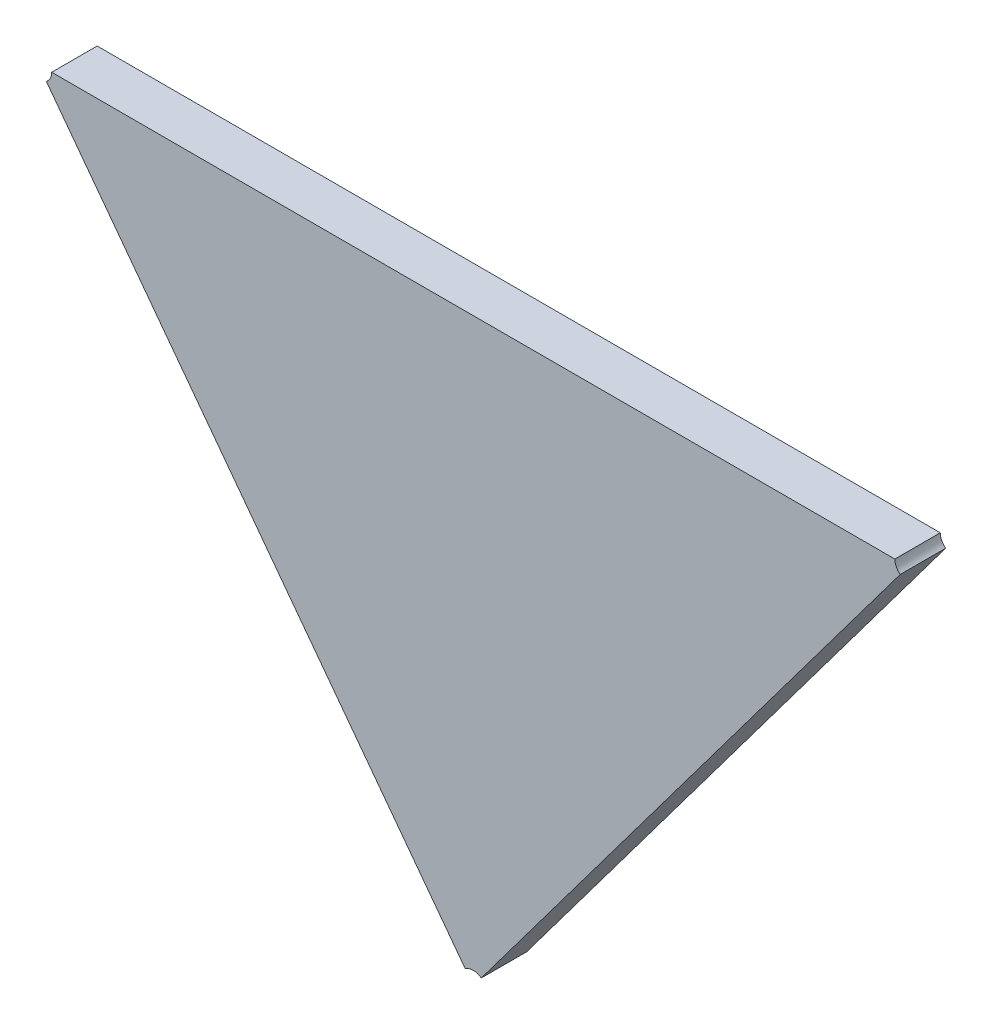
ISO-10303-21;
HEADER;
FILE_DESCRIPTION(('STEP AP214'),'2;1');
FILE_NAME('part.step','',(''),(''),'','','');
FILE_SCHEMA(('AUTOMOTIVE_DESIGN { 1 0 10303 214 1 1 1 1 }'));
ENDSEC;
DATA;
#1=APPLICATION_CONTEXT('core data for automotive mechanical design processes');
#2=APPLICATION_PROTOCOL_DEFINITION('international standard','automotive_design',2000,#1);
#3=PRODUCT_CONTEXT('',#1,'mechanical');
#4=PRODUCT('Part','Part','',(#3));
#5=PRODUCT_RELATED_PRODUCT_CATEGORY('part','',(#4));
#6=PRODUCT_DEFINITION_FORMATION('','',#4);
#7=PRODUCT_DEFINITION_CONTEXT('part definition',#1,'design');
#8=PRODUCT_DEFINITION('design','',#6,#7);
#9=PRODUCT_DEFINITION_SHAPE('','',#8);
#10=(LENGTH_UNIT() NAMED_UNIT(*) SI_UNIT(.MILLI.,.METRE.));
#11=(NAMED_UNIT(*) PLANE_ANGLE_UNIT() SI_UNIT($,.RADIAN.));
#12=(NAMED_UNIT(*) SI_UNIT($,.STERADIAN.) SOLID_ANGLE_UNIT());
#13=UNCERTAINTY_MEASURE_WITH_UNIT(LENGTH_MEASURE(1.E-05),#10,'distance_accuracy_value','');
#14=(GEOMETRIC_REPRESENTATION_CONTEXT(3) GLOBAL_UNCERTAINTY_ASSIGNED_CONTEXT((#13)) GLOBAL_UNIT_ASSIGNED_CONTEXT((#10,
#11,#12)) REPRESENTATION_CONTEXT('',''));
#15=CARTESIAN_POINT('',(0.,0.,0.));
#16=DIRECTION('',(0.,0.,1.));
#17=DIRECTION('',(1.,0.,0.));
#18=AXIS2_PLACEMENT_3D('',#15,#16,#17);
#19=CARTESIAN_POINT('',(-1.64562904813006,-1.33581418659048,0.0042));
#20=DIRECTION('',(0.,0.,1.));
#21=DIRECTION('',(1.,0.,0.));
#22=AXIS2_PLACEMENT_3D('',#19,#20,#21);
#23=PLANE('',#22);
#24=CARTESIAN_POINT('',(-1.71069826462096,-1.30862866219989,0.0042));
#25=DIRECTION('',(0.,0.,-1.));
#26=DIRECTION('',(1.,0.,0.));
#27=AXIS2_PLACEMENT_3D('',#24,#25,#26);
#28=CIRCLE('',#27,0.00199999999999999);
#29=CARTESIAN_POINT('',(-1.70869826462096,-1.30862866219989,0.0042));
#30=VERTEX_POINT('',#29);
#31=CARTESIAN_POINT('',(-1.70949881097527,-1.3102290718199,0.0042));
#32=VERTEX_POINT('',#31);
#33=EDGE_CURVE('E11',#30,#32,#28,.T.);
#34=ORIENTED_EDGE('',*,*,#33,.T.);
#35=DIRECTION('',(0.599726822848934,-0.800204810005241,0.));
#36=VECTOR('',#35,1.);
#37=CARTESIAN_POINT('',(-1.70949881097527,-1.3102290718199,0.0042));
#38=LINE('',#37,#36);
#39=CARTESIAN_POINT('',(-1.64682850177576,-1.39384894832924,0.0042));
#40=VERTEX_POINT('',#39);
#41=EDGE_CURVE('E114',#32,#40,#38,.T.);
#42=ORIENTED_EDGE('',*,*,#41,.T.);
#43=CARTESIAN_POINT('',(-1.64562904813006,-1.39544935794925,0.0042));
#44=DIRECTION('',(0.,0.,-1.));
#45=DIRECTION('',(-0.59972682284971,0.800204810004659,0.));
#46=AXIS2_PLACEMENT_3D('',#43,#44,#45);
#47=CIRCLE('',#46,0.00200000000000003);
#48=CARTESIAN_POINT('',(-1.64442959448436,-1.39384894832924,0.0042));
#49=VERTEX_POINT('',#48);
#50=EDGE_CURVE('E90',#40,#49,#47,.T.);
#51=ORIENTED_EDGE('',*,*,#50,.T.);
#52=DIRECTION('',(0.599726822848933,0.800204810005241,0.));
#53=VECTOR('',#52,1.);
#54=CARTESIAN_POINT('',(-1.64442959448436,-1.39384894832924,0.0042));
#55=LINE('',#54,#53);
#56=CARTESIAN_POINT('',(-1.58175928528485,-1.3102290718199,0.0042));
#57=VERTEX_POINT('',#56);
#58=EDGE_CURVE('E102',#49,#57,#55,.T.);
#59=ORIENTED_EDGE('',*,*,#58,.T.);
#60=CARTESIAN_POINT('',(-1.58055983163915,-1.30862866219989,0.0042));
#61=DIRECTION('',(0.,0.,-1.));
#62=DIRECTION('',(-0.59972682284971,-0.800204810004659,0.));
#63=AXIS2_PLACEMENT_3D('',#60,#61,#62);
#64=CIRCLE('',#63,0.00200000000000002);
#65=CARTESIAN_POINT('',(-1.58255983163915,-1.30862866219989,0.0042));
#66=VERTEX_POINT('',#65);
#67=EDGE_CURVE('E77',#57,#66,#64,.T.);
#68=ORIENTED_EDGE('',*,*,#67,.T.);
#69=DIRECTION('',(-1.,0.,0.));
#70=VECTOR('',#69,1.);
#71=CARTESIAN_POINT('',(-1.58255983163915,-1.30862866219989,0.0042));
#72=LINE('',#71,#70);
#73=EDGE_CURVE('E110',#66,#30,#72,.T.);
#74=ORIENTED_EDGE('',*,*,#73,.T.);
#75=EDGE_LOOP('',(#34,#42,#51,#59,#68,#74));
#76=FACE_BOUND('',#75,.T.);
#77=ADVANCED_FACE('F17',(#76),#23,.T.);
#78=CARTESIAN_POINT('',(-1.58055983163915,-1.30862866219989,-0.0026));
#79=DIRECTION('',(0.,1.,0.));
#80=DIRECTION('',(-1.,0.,0.));
#81=AXIS2_PLACEMENT_3D('',#78,#79,#80);
#82=PLANE('',#81);
#83=DIRECTION('',(0.,0.,1.));
#84=VECTOR('',#83,1.);
#85=CARTESIAN_POINT('',(-1.70869826462096,-1.30862866219989,-0.0026));
#86=LINE('',#85,#84);
#87=CARTESIAN_POINT('',(-1.70869826462096,-1.30862866219989,-0.0026));
#88=VERTEX_POINT('',#87);
#89=EDGE_CURVE('E24',#88,#30,#86,.T.);
#90=ORIENTED_EDGE('',*,*,#89,.T.);
#91=ORIENTED_EDGE('',*,*,#73,.F.);
#92=DIRECTION('',(0.,0.,-1.));
#93=VECTOR('',#92,1.);
#94=CARTESIAN_POINT('',(-1.58255983163915,-1.30862866219989,0.0042));
#95=LINE('',#94,#93);
#96=CARTESIAN_POINT('',(-1.58255983163915,-1.30862866219989,-0.0026));
#97=VERTEX_POINT('',#96);
#98=EDGE_CURVE('E104',#66,#97,#95,.T.);
#99=ORIENTED_EDGE('',*,*,#98,.T.);
#100=DIRECTION('',(-1.,0.,0.));
#101=VECTOR('',#100,1.);
#102=CARTESIAN_POINT('',(-1.58255983163915,-1.30862866219989,-0.0026));
#103=LINE('',#102,#101);
#104=EDGE_CURVE('E99',#97,#88,#103,.T.);
#105=ORIENTED_EDGE('',*,*,#104,.T.);
#106=EDGE_LOOP('',(#90,#91,#99,#105));
#107=FACE_BOUND('',#106,.T.);
#108=ADVANCED_FACE('F120',(#107),#82,.T.);
#109=CARTESIAN_POINT('',(-1.64562904813006,-1.39544935794925,-0.0026));
#110=DIRECTION('',(0.800204810005241,-0.599726822848934,0.));
#111=DIRECTION('',(0.599726822848934,0.800204810005241,0.));
#112=AXIS2_PLACEMENT_3D('',#109,#110,#111);
#113=PLANE('',#112);
#114=DIRECTION('',(0.,0.,-1.));
#115=VECTOR('',#114,1.);
#116=CARTESIAN_POINT('',(-1.64442959448436,-1.39384894832924,0.0042));
#117=LINE('',#116,#115);
#118=CARTESIAN_POINT('',(-1.64442959448436,-1.39384894832924,-0.0026));
#119=VERTEX_POINT('',#118);
#120=EDGE_CURVE('E112',#49,#119,#117,.T.);
#121=ORIENTED_EDGE('',*,*,#120,.T.);
#122=DIRECTION('',(0.599726822848934,0.80020481000524,0.));
#123=VECTOR('',#122,1.);
#124=CARTESIAN_POINT('',(-1.64442959448436,-1.39384894832924,-0.0026));
#125=LINE('',#124,#123);
#126=CARTESIAN_POINT('',(-1.58175928528485,-1.3102290718199,-0.0026));
#127=VERTEX_POINT('',#126);
#128=EDGE_CURVE('E85',#119,#127,#125,.T.);
#129=ORIENTED_EDGE('',*,*,#128,.T.);
#130=DIRECTION('',(0.,0.,1.));
#131=VECTOR('',#130,1.);
#132=CARTESIAN_POINT('',(-1.58175928528485,-1.3102290718199,-0.0026));
#133=LINE('',#132,#131);
#134=EDGE_CURVE('E96',#127,#57,#133,.T.);
#135=ORIENTED_EDGE('',*,*,#134,.T.);
#136=ORIENTED_EDGE('',*,*,#58,.F.);
#137=EDGE_LOOP('',(#121,#129,#135,#136));
#138=FACE_BOUND('',#137,.T.);
#139=ADVANCED_FACE('F127',(#138),#113,.T.);
#140=CARTESIAN_POINT('',(-1.62394239474017,-1.34119105521901,-0.0026));
#141=DIRECTION('',(0.,0.,1.));
#142=DIRECTION('',(1.,0.,0.));
#143=AXIS2_PLACEMENT_3D('',#140,#141,#142);
#144=PLANE('',#143);
#145=CARTESIAN_POINT('',(-1.71069826462096,-1.30862866219989,-0.0026));
#146=DIRECTION('',(0.,0.,1.));
#147=DIRECTION('',(0.599726822846601,-0.800204810006989,0.));
#148=AXIS2_PLACEMENT_3D('',#145,#146,#147);
#149=CIRCLE('',#148,0.00199999999999999);
#150=CARTESIAN_POINT('',(-1.70949881097527,-1.3102290718199,-0.0026));
#151=VERTEX_POINT('',#150);
#152=EDGE_CURVE('E107',#151,#88,#149,.T.);
#153=ORIENTED_EDGE('',*,*,#152,.T.);
#154=ORIENTED_EDGE('',*,*,#104,.F.);
#155=CARTESIAN_POINT('',(-1.58055983163915,-1.30862866219989,-0.0026));
#156=DIRECTION('',(0.,0.,1.));
#157=DIRECTION('',(-1.,0.,0.));
#158=AXIS2_PLACEMENT_3D('',#155,#156,#157);
#159=CIRCLE('',#158,0.00200000000000002);
#160=EDGE_CURVE('E78',#97,#127,#159,.T.);
#161=ORIENTED_EDGE('',*,*,#160,.T.);
#162=ORIENTED_EDGE('',*,*,#128,.F.);
#163=CARTESIAN_POINT('',(-1.64562904813006,-1.39544935794925,-0.0026));
#164=DIRECTION('',(0.,0.,1.));
#165=DIRECTION('',(0.59972682284971,0.800204810004659,0.));
#166=AXIS2_PLACEMENT_3D('',#163,#164,#165);
#167=CIRCLE('',#166,0.00200000000000003);
#168=CARTESIAN_POINT('',(-1.64682850177576,-1.39384894832924,-0.0026));
#169=VERTEX_POINT('',#168);
#170=EDGE_CURVE('E82',#119,#169,#167,.T.);
#171=ORIENTED_EDGE('',*,*,#170,.T.);
#172=DIRECTION('',(-0.599726822848935,0.80020481000524,0.));
#173=VECTOR('',#172,1.);
#174=CARTESIAN_POINT('',(-1.64682850177576,-1.39384894832924,-0.0026));
#175=LINE('',#174,#173);
#176=EDGE_CURVE('E67',#169,#151,#175,.T.);
#177=ORIENTED_EDGE('',*,*,#176,.T.);
#178=EDGE_LOOP('',(#153,#154,#161,#162,#171,#177));
#179=FACE_BOUND('',#178,.T.);
#180=ADVANCED_FACE('F83',(#179),#144,.F.);
#181=CARTESIAN_POINT('',(-1.64562904813006,-1.39544935794925,-0.0026));
#182=DIRECTION('',(0.800204810005241,0.599726822848934,0.));
#183=DIRECTION('',(-0.599726822848934,0.800204810005241,0.));
#184=AXIS2_PLACEMENT_3D('',#181,#182,#183);
#185=PLANE('',#184);
#186=DIRECTION('',(0.,0.,1.));
#187=VECTOR('',#186,1.);
#188=CARTESIAN_POINT('',(-1.70949881097527,-1.3102290718199,-0.0026));
#189=LINE('',#188,#187);
#190=EDGE_CURVE('E74',#151,#32,#189,.T.);
#191=ORIENTED_EDGE('',*,*,#190,.F.);
#192=ORIENTED_EDGE('',*,*,#176,.F.);
#193=DIRECTION('',(0.,0.,1.));
#194=VECTOR('',#193,1.);
#195=CARTESIAN_POINT('',(-1.64682850177576,-1.39384894832924,-0.0026));
#196=LINE('',#195,#194);
#197=EDGE_CURVE('E71',#169,#40,#196,.T.);
#198=ORIENTED_EDGE('',*,*,#197,.T.);
#199=ORIENTED_EDGE('',*,*,#41,.F.);
#200=EDGE_LOOP('',(#191,#192,#198,#199));
#201=FACE_BOUND('',#200,.T.);
#202=ADVANCED_FACE('F69',(#201),#185,.F.);
#203=CARTESIAN_POINT('',(-1.58055983163915,-1.30862866219989,-0.0018));
#204=DIRECTION('',(0.,0.,1.));
#205=DIRECTION('',(-1.,0.,0.));
#206=AXIS2_PLACEMENT_3D('',#203,#204,#205);
#207=CYLINDRICAL_SURFACE('',#206,0.00200000000000002);
#208=ORIENTED_EDGE('',*,*,#98,.F.);
#209=ORIENTED_EDGE('',*,*,#67,.F.);
#210=ORIENTED_EDGE('',*,*,#134,.F.);
#211=ORIENTED_EDGE('',*,*,#160,.F.);
#212=EDGE_LOOP('',(#208,#209,#210,#211));
#213=FACE_BOUND('',#212,.T.);
#214=ADVANCED_FACE('F124',(#213),#207,.F.);
#215=CARTESIAN_POINT('',(-1.64562904813006,-1.39544935794925,-0.0018));
#216=DIRECTION('',(0.,0.,1.));
#217=DIRECTION('',(-1.,0.,0.));
#218=AXIS2_PLACEMENT_3D('',#215,#216,#217);
#219=CYLINDRICAL_SURFACE('',#218,0.00200000000000003);
#220=ORIENTED_EDGE('',*,*,#120,.F.);
#221=ORIENTED_EDGE('',*,*,#50,.F.);
#222=ORIENTED_EDGE('',*,*,#197,.F.);
#223=ORIENTED_EDGE('',*,*,#170,.F.);
#224=EDGE_LOOP('',(#220,#221,#222,#223));
#225=FACE_BOUND('',#224,.T.);
#226=ADVANCED_FACE('F89',(#225),#219,.F.);
#227=CARTESIAN_POINT('',(-1.71069826462096,-1.30862866219989,-0.0018));
#228=DIRECTION('',(0.,0.,1.));
#229=DIRECTION('',(-1.,0.,0.));
#230=AXIS2_PLACEMENT_3D('',#227,#228,#229);
#231=CYLINDRICAL_SURFACE('',#230,0.00199999999999999);
#232=ORIENTED_EDGE('',*,*,#89,.F.);
#233=ORIENTED_EDGE('',*,*,#152,.F.);
#234=ORIENTED_EDGE('',*,*,#190,.T.);
#235=ORIENTED_EDGE('',*,*,#33,.F.);
#236=EDGE_LOOP('',(#232,#233,#234,#235));
#237=FACE_BOUND('',#236,.T.);
#238=ADVANCED_FACE('F117',(#237),#231,.F.);
#239=CLOSED_SHELL('',(#77,#108,#139,#180,#202,#214,#226,#238));
#240=MANIFOLD_SOLID_BREP('B1',#239);
#241=ADVANCED_BREP_SHAPE_REPRESENTATION('',(#18,#240),#14);
#242=SHAPE_DEFINITION_REPRESENTATION(#9,#241);
ENDSEC;
END-ISO-10303-21;
